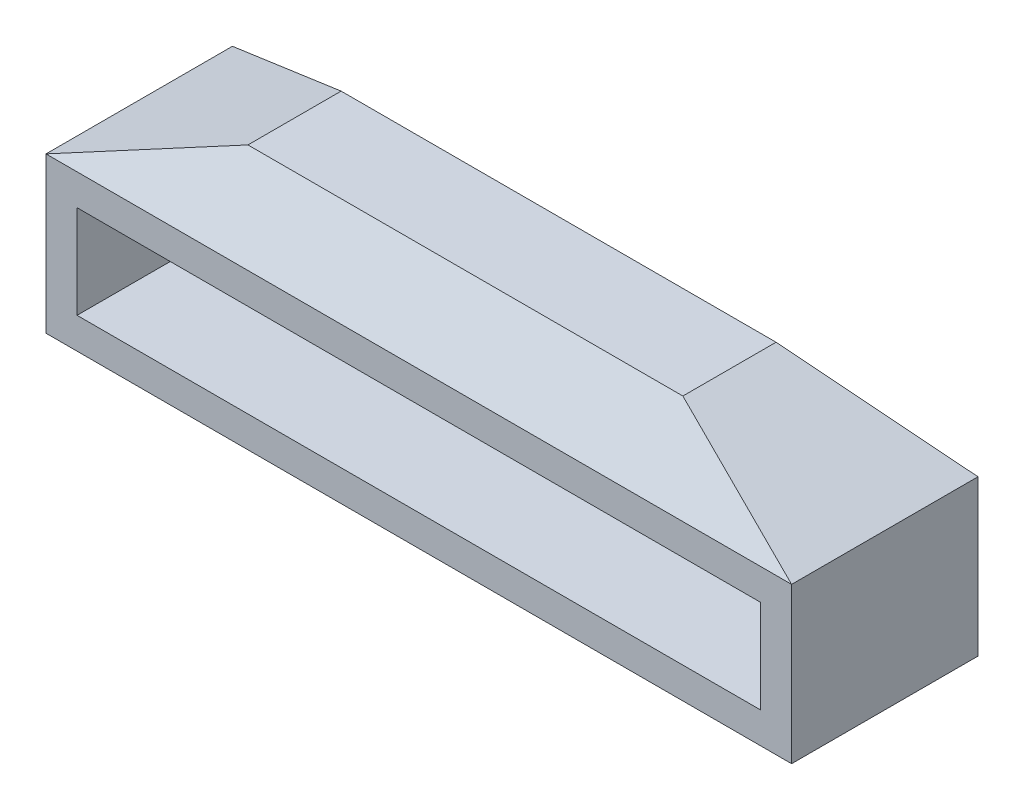
ISO-10303-21;
HEADER;
FILE_DESCRIPTION(('STEP AP214'),'2;1');
FILE_NAME('part.step','',(''),(''),'','','');
FILE_SCHEMA(('AUTOMOTIVE_DESIGN { 1 0 10303 214 1 1 1 1 }'));
ENDSEC;
DATA;
#1=APPLICATION_CONTEXT('core data for automotive mechanical design processes');
#2=APPLICATION_PROTOCOL_DEFINITION('international standard','automotive_design',2000,#1);
#3=PRODUCT_CONTEXT('',#1,'mechanical');
#4=PRODUCT('Part','Part','',(#3));
#5=PRODUCT_RELATED_PRODUCT_CATEGORY('part','',(#4));
#6=PRODUCT_DEFINITION_FORMATION('','',#4);
#7=PRODUCT_DEFINITION_CONTEXT('part definition',#1,'design');
#8=PRODUCT_DEFINITION('design','',#6,#7);
#9=PRODUCT_DEFINITION_SHAPE('','',#8);
#10=(LENGTH_UNIT() NAMED_UNIT(*) SI_UNIT(.MILLI.,.METRE.));
#11=(NAMED_UNIT(*) PLANE_ANGLE_UNIT() SI_UNIT($,.RADIAN.));
#12=(NAMED_UNIT(*) SI_UNIT($,.STERADIAN.) SOLID_ANGLE_UNIT());
#13=UNCERTAINTY_MEASURE_WITH_UNIT(LENGTH_MEASURE(1.E-05),#10,'distance_accuracy_value','');
#14=(GEOMETRIC_REPRESENTATION_CONTEXT(3) GLOBAL_UNCERTAINTY_ASSIGNED_CONTEXT((#13)) GLOBAL_UNIT_ASSIGNED_CONTEXT((#10,
#11,#12)) REPRESENTATION_CONTEXT('',''));
#15=CARTESIAN_POINT('',(0.,0.,0.));
#16=DIRECTION('',(0.,0.,1.));
#17=DIRECTION('',(1.,0.,0.));
#18=AXIS2_PLACEMENT_3D('',#15,#16,#17);
#19=CARTESIAN_POINT('',(11.,4.00000000000001,6.));
#20=DIRECTION('',(0.,-1.,0.));
#21=DIRECTION('',(1.,0.,0.));
#22=AXIS2_PLACEMENT_3D('',#19,#20,#21);
#23=PLANE('',#22);
#24=DIRECTION('',(-1.,0.,0.));
#25=VECTOR('',#24,1.);
#26=CARTESIAN_POINT('',(11.,4.00000000000001,0.));
#27=LINE('',#26,#25);
#28=CARTESIAN_POINT('',(11.,4.00000000000001,0.));
#29=VERTEX_POINT('',#28);
#30=CARTESIAN_POINT('',(-11.,4.,0.));
#31=VERTEX_POINT('',#30);
#32=EDGE_CURVE('E272',#29,#31,#27,.T.);
#33=ORIENTED_EDGE('',*,*,#32,.F.);
#34=DIRECTION('',(0.,0.,-1.));
#35=VECTOR('',#34,1.);
#36=CARTESIAN_POINT('',(11.,4.00000000000001,6.));
#37=LINE('',#36,#35);
#38=CARTESIAN_POINT('',(11.,4.00000000000001,6.));
#39=VERTEX_POINT('',#38);
#40=EDGE_CURVE('E66',#39,#29,#37,.T.);
#41=ORIENTED_EDGE('',*,*,#40,.F.);
#42=DIRECTION('',(-1.,0.,0.));
#43=VECTOR('',#42,1.);
#44=CARTESIAN_POINT('',(11.,4.00000000000001,6.));
#45=LINE('',#44,#43);
#46=CARTESIAN_POINT('',(-11.,4.,6.));
#47=VERTEX_POINT('',#46);
#48=EDGE_CURVE('E276',#39,#47,#45,.T.);
#49=ORIENTED_EDGE('',*,*,#48,.T.);
#50=DIRECTION('',(0.,0.,-1.));
#51=VECTOR('',#50,1.);
#52=CARTESIAN_POINT('',(-11.,4.,6.));
#53=LINE('',#52,#51);
#54=EDGE_CURVE('E278',#47,#31,#53,.T.);
#55=ORIENTED_EDGE('',*,*,#54,.T.);
#56=EDGE_LOOP('',(#33,#41,#49,#55));
#57=FACE_BOUND('',#56,.T.);
#58=DIRECTION('',(1.,0.,0.));
#59=VECTOR('',#58,1.);
#60=CARTESIAN_POINT('',(-6.,4.,2.74999999999999));
#61=LINE('',#60,#59);
#62=CARTESIAN_POINT('',(-6.,4.,2.74999999999999));
#63=VERTEX_POINT('',#62);
#64=CARTESIAN_POINT('',(6.,4.00000000000001,2.74999999999998));
#65=VERTEX_POINT('',#64);
#66=EDGE_CURVE('E51',#63,#65,#61,.T.);
#67=ORIENTED_EDGE('',*,*,#66,.F.);
#68=DIRECTION('',(0.,0.,1.));
#69=VECTOR('',#68,1.);
#70=CARTESIAN_POINT('',(-6.,4.,6.));
#71=LINE('',#70,#69);
#72=CARTESIAN_POINT('',(-6.,4.,3.25000000000001));
#73=VERTEX_POINT('',#72);
#74=EDGE_CURVE('E12',#63,#73,#71,.T.);
#75=ORIENTED_EDGE('',*,*,#74,.T.);
#76=DIRECTION('',(1.,0.,0.));
#77=VECTOR('',#76,1.);
#78=CARTESIAN_POINT('',(-6.,4.,3.25000000000001));
#79=LINE('',#78,#77);
#80=CARTESIAN_POINT('',(6.,4.00000000000001,3.25000000000002));
#81=VERTEX_POINT('',#80);
#82=EDGE_CURVE('E174',#81,#73,#79,.F.);
#83=ORIENTED_EDGE('',*,*,#82,.F.);
#84=DIRECTION('',(0.,0.,1.));
#85=VECTOR('',#84,1.);
#86=CARTESIAN_POINT('',(6.,4.00000000000001,6.));
#87=LINE('',#86,#85);
#88=EDGE_CURVE('E172',#65,#81,#87,.T.);
#89=ORIENTED_EDGE('',*,*,#88,.F.);
#90=EDGE_LOOP('',(#67,#75,#83,#89));
#91=FACE_BOUND('',#90,.T.);
#92=ADVANCED_FACE('F43',(#57,#91),#23,.T.);
#93=CARTESIAN_POINT('',(0.,0.,6.));
#94=DIRECTION('',(0.,0.,1.));
#95=DIRECTION('',(1.,0.,0.));
#96=AXIS2_PLACEMENT_3D('',#93,#94,#95);
#97=PLANE('',#96);
#98=DIRECTION('',(0.,-1.,0.));
#99=VECTOR('',#98,1.);
#100=CARTESIAN_POINT('',(-12.,5.00000000000001,6.));
#101=LINE('',#100,#99);
#102=CARTESIAN_POINT('',(-12.,5.,6.));
#103=VERTEX_POINT('',#102);
#104=CARTESIAN_POINT('',(-12.,0.,6.));
#105=VERTEX_POINT('',#104);
#106=EDGE_CURVE('E157',#103,#105,#101,.T.);
#107=ORIENTED_EDGE('',*,*,#106,.T.);
#108=DIRECTION('',(1.,0.,0.));
#109=VECTOR('',#108,1.);
#110=CARTESIAN_POINT('',(-12.,0.,6.));
#111=LINE('',#110,#109);
#112=CARTESIAN_POINT('',(12.,0.,6.));
#113=VERTEX_POINT('',#112);
#114=EDGE_CURVE('E163',#105,#113,#111,.T.);
#115=ORIENTED_EDGE('',*,*,#114,.T.);
#116=DIRECTION('',(0.,1.,0.));
#117=VECTOR('',#116,1.);
#118=CARTESIAN_POINT('',(12.,0.,6.));
#119=LINE('',#118,#117);
#120=CARTESIAN_POINT('',(12.,5.00000000000001,6.));
#121=VERTEX_POINT('',#120);
#122=EDGE_CURVE('E151',#113,#121,#119,.T.);
#123=ORIENTED_EDGE('',*,*,#122,.T.);
#124=DIRECTION('',(1.,0.,0.));
#125=VECTOR('',#124,1.);
#126=CARTESIAN_POINT('',(0.,5.00000000000001,6.));
#127=LINE('',#126,#125);
#128=EDGE_CURVE('E162',#121,#103,#127,.F.);
#129=ORIENTED_EDGE('',*,*,#128,.T.);
#130=EDGE_LOOP('',(#107,#115,#123,#129));
#131=FACE_BOUND('',#130,.T.);
#132=DIRECTION('',(1.,0.,0.));
#133=VECTOR('',#132,1.);
#134=CARTESIAN_POINT('',(-11.,1.,6.));
#135=LINE('',#134,#133);
#136=CARTESIAN_POINT('',(-11.,1.,6.));
#137=VERTEX_POINT('',#136);
#138=CARTESIAN_POINT('',(11.,0.999999999999998,6.));
#139=VERTEX_POINT('',#138);
#140=EDGE_CURVE('E271',#137,#139,#135,.T.);
#141=ORIENTED_EDGE('',*,*,#140,.F.);
#142=DIRECTION('',(0.,-1.,0.));
#143=VECTOR('',#142,1.);
#144=CARTESIAN_POINT('',(-11.,4.,6.));
#145=LINE('',#144,#143);
#146=EDGE_CURVE('E264',#47,#137,#145,.T.);
#147=ORIENTED_EDGE('',*,*,#146,.F.);
#148=ORIENTED_EDGE('',*,*,#48,.F.);
#149=DIRECTION('',(0.,1.,0.));
#150=VECTOR('',#149,1.);
#151=CARTESIAN_POINT('',(11.,0.999999999999998,6.));
#152=LINE('',#151,#150);
#153=EDGE_CURVE('E274',#139,#39,#152,.T.);
#154=ORIENTED_EDGE('',*,*,#153,.F.);
#155=EDGE_LOOP('',(#141,#147,#148,#154));
#156=FACE_BOUND('',#155,.T.);
#157=ADVANCED_FACE('F299',(#131,#156),#97,.T.);
#158=CARTESIAN_POINT('',(0.,0.,0.));
#159=DIRECTION('',(0.,0.,1.));
#160=DIRECTION('',(1.,0.,0.));
#161=AXIS2_PLACEMENT_3D('',#158,#159,#160);
#162=PLANE('',#161);
#163=DIRECTION('',(0.,-1.,0.));
#164=VECTOR('',#163,1.);
#165=CARTESIAN_POINT('',(-12.,5.00000000000001,0.));
#166=LINE('',#165,#164);
#167=CARTESIAN_POINT('',(-12.,5.00000000000001,0.));
#168=VERTEX_POINT('',#167);
#169=CARTESIAN_POINT('',(-12.,0.,0.));
#170=VERTEX_POINT('',#169);
#171=EDGE_CURVE('E145',#168,#170,#166,.T.);
#172=ORIENTED_EDGE('',*,*,#171,.F.);
#173=DIRECTION('',(1.,0.,0.));
#174=VECTOR('',#173,1.);
#175=CARTESIAN_POINT('',(0.,5.00000000000001,0.));
#176=LINE('',#175,#174);
#177=CARTESIAN_POINT('',(12.,5.00000000000001,0.));
#178=VERTEX_POINT('',#177);
#179=EDGE_CURVE('E91',#178,#168,#176,.F.);
#180=ORIENTED_EDGE('',*,*,#179,.F.);
#181=DIRECTION('',(0.,1.,0.));
#182=VECTOR('',#181,1.);
#183=CARTESIAN_POINT('',(12.,0.,0.));
#184=LINE('',#183,#182);
#185=CARTESIAN_POINT('',(12.,0.,0.));
#186=VERTEX_POINT('',#185);
#187=EDGE_CURVE('E144',#186,#178,#184,.T.);
#188=ORIENTED_EDGE('',*,*,#187,.F.);
#189=DIRECTION('',(1.,0.,0.));
#190=VECTOR('',#189,1.);
#191=CARTESIAN_POINT('',(-12.,0.,0.));
#192=LINE('',#191,#190);
#193=EDGE_CURVE('E136',#170,#186,#192,.T.);
#194=ORIENTED_EDGE('',*,*,#193,.F.);
#195=EDGE_LOOP('',(#172,#180,#188,#194));
#196=FACE_BOUND('',#195,.T.);
#197=DIRECTION('',(0.,-1.,0.));
#198=VECTOR('',#197,1.);
#199=CARTESIAN_POINT('',(-11.,4.,0.));
#200=LINE('',#199,#198);
#201=CARTESIAN_POINT('',(-11.,1.,0.));
#202=VERTEX_POINT('',#201);
#203=EDGE_CURVE('E279',#31,#202,#200,.T.);
#204=ORIENTED_EDGE('',*,*,#203,.T.);
#205=DIRECTION('',(1.,0.,0.));
#206=VECTOR('',#205,1.);
#207=CARTESIAN_POINT('',(-11.,1.,0.));
#208=LINE('',#207,#206);
#209=CARTESIAN_POINT('',(11.,0.999999999999998,0.));
#210=VERTEX_POINT('',#209);
#211=EDGE_CURVE('E282',#202,#210,#208,.T.);
#212=ORIENTED_EDGE('',*,*,#211,.T.);
#213=DIRECTION('',(0.,1.,0.));
#214=VECTOR('',#213,1.);
#215=CARTESIAN_POINT('',(11.,0.999999999999998,0.));
#216=LINE('',#215,#214);
#217=EDGE_CURVE('E286',#210,#29,#216,.T.);
#218=ORIENTED_EDGE('',*,*,#217,.T.);
#219=ORIENTED_EDGE('',*,*,#32,.T.);
#220=EDGE_LOOP('',(#204,#212,#218,#219));
#221=FACE_BOUND('',#220,.T.);
#222=ADVANCED_FACE('F154',(#196,#221),#162,.F.);
#223=CARTESIAN_POINT('',(-12.,5.00000000000001,6.));
#224=DIRECTION('',(1.,0.,0.));
#225=DIRECTION('',(0.,0.,-1.));
#226=AXIS2_PLACEMENT_3D('',#223,#224,#225);
#227=PLANE('',#226);
#228=ORIENTED_EDGE('',*,*,#171,.T.);
#229=DIRECTION('',(0.,0.,-1.));
#230=VECTOR('',#229,1.);
#231=CARTESIAN_POINT('',(-12.,0.,6.));
#232=LINE('',#231,#230);
#233=EDGE_CURVE('E142',#105,#170,#232,.T.);
#234=ORIENTED_EDGE('',*,*,#233,.F.);
#235=ORIENTED_EDGE('',*,*,#106,.F.);
#236=DIRECTION('',(0.,0.,-1.));
#237=VECTOR('',#236,1.);
#238=CARTESIAN_POINT('',(-12.,5.00000000000001,6.));
#239=LINE('',#238,#237);
#240=EDGE_CURVE('E168',#103,#168,#239,.T.);
#241=ORIENTED_EDGE('',*,*,#240,.T.);
#242=EDGE_LOOP('',(#228,#234,#235,#241));
#243=FACE_BOUND('',#242,.T.);
#244=ADVANCED_FACE('F45',(#243),#227,.F.);
#245=CARTESIAN_POINT('',(-12.,0.,6.));
#246=DIRECTION('',(0.,1.,0.));
#247=DIRECTION('',(0.,0.,1.));
#248=AXIS2_PLACEMENT_3D('',#245,#246,#247);
#249=PLANE('',#248);
#250=ORIENTED_EDGE('',*,*,#193,.T.);
#251=DIRECTION('',(0.,0.,-1.));
#252=VECTOR('',#251,1.);
#253=CARTESIAN_POINT('',(12.,0.,6.));
#254=LINE('',#253,#252);
#255=EDGE_CURVE('E139',#113,#186,#254,.T.);
#256=ORIENTED_EDGE('',*,*,#255,.F.);
#257=ORIENTED_EDGE('',*,*,#114,.F.);
#258=ORIENTED_EDGE('',*,*,#233,.T.);
#259=EDGE_LOOP('',(#250,#256,#257,#258));
#260=FACE_BOUND('',#259,.T.);
#261=ADVANCED_FACE('F138',(#260),#249,.F.);
#262=CARTESIAN_POINT('',(12.,0.,6.));
#263=DIRECTION('',(-1.,0.,0.));
#264=DIRECTION('',(0.,0.,1.));
#265=AXIS2_PLACEMENT_3D('',#262,#263,#264);
#266=PLANE('',#265);
#267=ORIENTED_EDGE('',*,*,#187,.T.);
#268=DIRECTION('',(0.,0.,1.));
#269=VECTOR('',#268,1.);
#270=CARTESIAN_POINT('',(12.,5.,0.));
#271=LINE('',#270,#269);
#272=EDGE_CURVE('E152',#121,#178,#271,.F.);
#273=ORIENTED_EDGE('',*,*,#272,.F.);
#274=ORIENTED_EDGE('',*,*,#122,.F.);
#275=ORIENTED_EDGE('',*,*,#255,.T.);
#276=EDGE_LOOP('',(#267,#273,#274,#275));
#277=FACE_BOUND('',#276,.T.);
#278=ADVANCED_FACE('F148',(#277),#266,.F.);
#279=CARTESIAN_POINT('',(-11.,4.,6.));
#280=DIRECTION('',(1.,0.,0.));
#281=DIRECTION('',(0.,0.,-1.));
#282=AXIS2_PLACEMENT_3D('',#279,#280,#281);
#283=PLANE('',#282);
#284=ORIENTED_EDGE('',*,*,#203,.F.);
#285=ORIENTED_EDGE('',*,*,#54,.F.);
#286=ORIENTED_EDGE('',*,*,#146,.T.);
#287=DIRECTION('',(0.,0.,-1.));
#288=VECTOR('',#287,1.);
#289=CARTESIAN_POINT('',(-11.,1.,6.));
#290=LINE('',#289,#288);
#291=EDGE_CURVE('E166',#137,#202,#290,.T.);
#292=ORIENTED_EDGE('',*,*,#291,.T.);
#293=EDGE_LOOP('',(#284,#285,#286,#292));
#294=FACE_BOUND('',#293,.T.);
#295=ADVANCED_FACE('F348',(#294),#283,.T.);
#296=CARTESIAN_POINT('',(-11.,1.,6.));
#297=DIRECTION('',(0.,1.,0.));
#298=DIRECTION('',(-1.,0.,0.));
#299=AXIS2_PLACEMENT_3D('',#296,#297,#298);
#300=PLANE('',#299);
#301=ORIENTED_EDGE('',*,*,#211,.F.);
#302=ORIENTED_EDGE('',*,*,#291,.F.);
#303=ORIENTED_EDGE('',*,*,#140,.T.);
#304=DIRECTION('',(0.,0.,-1.));
#305=VECTOR('',#304,1.);
#306=CARTESIAN_POINT('',(11.,0.999999999999998,6.));
#307=LINE('',#306,#305);
#308=EDGE_CURVE('E294',#139,#210,#307,.T.);
#309=ORIENTED_EDGE('',*,*,#308,.T.);
#310=EDGE_LOOP('',(#301,#302,#303,#309));
#311=FACE_BOUND('',#310,.T.);
#312=ADVANCED_FACE('F344',(#311),#300,.T.);
#313=CARTESIAN_POINT('',(11.,0.999999999999998,6.));
#314=DIRECTION('',(-1.,0.,0.));
#315=DIRECTION('',(0.,0.,1.));
#316=AXIS2_PLACEMENT_3D('',#313,#314,#315);
#317=PLANE('',#316);
#318=ORIENTED_EDGE('',*,*,#217,.F.);
#319=ORIENTED_EDGE('',*,*,#308,.F.);
#320=ORIENTED_EDGE('',*,*,#153,.T.);
#321=ORIENTED_EDGE('',*,*,#40,.T.);
#322=EDGE_LOOP('',(#318,#319,#320,#321));
#323=FACE_BOUND('',#322,.T.);
#324=ADVANCED_FACE('F237',(#323),#317,.T.);
#325=CARTESIAN_POINT('',(0.,7.00000000000001,0.));
#326=DIRECTION('',(0.,1.,0.));
#327=DIRECTION('',(-1.,0.,0.));
#328=AXIS2_PLACEMENT_3D('',#325,#326,#327);
#329=PLANE('',#328);
#330=DIRECTION('',(-1.,0.,0.));
#331=VECTOR('',#330,1.);
#332=CARTESIAN_POINT('',(7.,7.00000000000001,1.5));
#333=LINE('',#332,#331);
#334=CARTESIAN_POINT('',(7.,7.00000000000001,1.5));
#335=VERTEX_POINT('',#334);
#336=CARTESIAN_POINT('',(-7.,7.,1.5));
#337=VERTEX_POINT('',#336);
#338=EDGE_CURVE('E259',#335,#337,#333,.T.);
#339=ORIENTED_EDGE('',*,*,#338,.T.);
#340=DIRECTION('',(0.,0.,1.));
#341=VECTOR('',#340,1.);
#342=CARTESIAN_POINT('',(-7.,7.,1.5));
#343=LINE('',#342,#341);
#344=CARTESIAN_POINT('',(-7.,7.,4.5));
#345=VERTEX_POINT('',#344);
#346=EDGE_CURVE('E217',#337,#345,#343,.T.);
#347=ORIENTED_EDGE('',*,*,#346,.T.);
#348=DIRECTION('',(1.,0.,0.));
#349=VECTOR('',#348,1.);
#350=CARTESIAN_POINT('',(-7.,7.,4.5));
#351=LINE('',#350,#349);
#352=CARTESIAN_POINT('',(7.,7.00000000000001,4.5));
#353=VERTEX_POINT('',#352);
#354=EDGE_CURVE('E103',#345,#353,#351,.T.);
#355=ORIENTED_EDGE('',*,*,#354,.T.);
#356=DIRECTION('',(0.,0.,-1.));
#357=VECTOR('',#356,1.);
#358=CARTESIAN_POINT('',(7.,7.00000000000001,4.5));
#359=LINE('',#358,#357);
#360=EDGE_CURVE('E200',#353,#335,#359,.T.);
#361=ORIENTED_EDGE('',*,*,#360,.T.);
#362=EDGE_LOOP('',(#339,#347,#355,#361));
#363=FACE_BOUND('',#362,.T.);
#364=ADVANCED_FACE('F216',(#363),#329,.T.);
#365=CARTESIAN_POINT('',(0.,4.68000000000001,6.24));
#366=DIRECTION('',(0.,-0.600000000000001,-0.799999999999999));
#367=DIRECTION('',(0.,0.799999999999999,-0.600000000000001));
#368=AXIS2_PLACEMENT_3D('',#365,#366,#367);
#369=PLANE('',#368);
#370=DIRECTION('',(-0.894427190999916,0.357770876399966,-0.268328157299975));
#371=VECTOR('',#370,1.);
#372=CARTESIAN_POINT('',(12.,5.00000000000001,6.));
#373=LINE('',#372,#371);
#374=EDGE_CURVE('E195',#121,#353,#373,.T.);
#375=ORIENTED_EDGE('',*,*,#374,.T.);
#376=ORIENTED_EDGE('',*,*,#354,.F.);
#377=DIRECTION('',(0.894427190999916,0.357770876399966,-0.268328157299975));
#378=VECTOR('',#377,1.);
#379=CARTESIAN_POINT('',(-12.,5.00000000000001,6.));
#380=LINE('',#379,#378);
#381=EDGE_CURVE('E199',#103,#345,#380,.T.);
#382=ORIENTED_EDGE('',*,*,#381,.F.);
#383=ORIENTED_EDGE('',*,*,#128,.F.);
#384=EDGE_LOOP('',(#375,#376,#382,#383));
#385=FACE_BOUND('',#384,.T.);
#386=ADVANCED_FACE('F197',(#385),#369,.F.);
#387=CARTESIAN_POINT('',(-3.37931034482759,8.44827586206897,0.));
#388=DIRECTION('',(0.371390676354104,-0.928476690885259,0.));
#389=DIRECTION('',(0.92847669088526,0.371390676354104,0.));
#390=AXIS2_PLACEMENT_3D('',#387,#388,#389);
#391=PLANE('',#390);
#392=ORIENTED_EDGE('',*,*,#381,.T.);
#393=ORIENTED_EDGE('',*,*,#346,.F.);
#394=DIRECTION('',(0.894427190999916,0.357770876399966,0.268328157299975));
#395=VECTOR('',#394,1.);
#396=CARTESIAN_POINT('',(-12.,5.00000000000001,0.));
#397=LINE('',#396,#395);
#398=EDGE_CURVE('E283',#168,#337,#397,.T.);
#399=ORIENTED_EDGE('',*,*,#398,.F.);
#400=ORIENTED_EDGE('',*,*,#240,.F.);
#401=EDGE_LOOP('',(#392,#393,#399,#400));
#402=FACE_BOUND('',#401,.T.);
#403=ADVANCED_FACE('F309',(#402),#391,.F.);
#404=CARTESIAN_POINT('',(3.37931034482759,8.44827586206897,0.));
#405=DIRECTION('',(-0.371390676354104,-0.928476690885259,0.));
#406=DIRECTION('',(0.928476690885259,-0.371390676354104,0.));
#407=AXIS2_PLACEMENT_3D('',#404,#405,#406);
#408=PLANE('',#407);
#409=DIRECTION('',(-0.894427190999916,0.357770876399966,0.268328157299975));
#410=VECTOR('',#409,1.);
#411=CARTESIAN_POINT('',(12.,5.00000000000001,0.));
#412=LINE('',#411,#410);
#413=EDGE_CURVE('E206',#178,#335,#412,.T.);
#414=ORIENTED_EDGE('',*,*,#413,.T.);
#415=ORIENTED_EDGE('',*,*,#360,.F.);
#416=ORIENTED_EDGE('',*,*,#374,.F.);
#417=ORIENTED_EDGE('',*,*,#272,.T.);
#418=EDGE_LOOP('',(#414,#415,#416,#417));
#419=FACE_BOUND('',#418,.T.);
#420=ADVANCED_FACE('F204',(#419),#408,.F.);
#421=CARTESIAN_POINT('',(0.,1.80000000000001,-2.4));
#422=DIRECTION('',(0.,-0.600000000000001,0.799999999999999));
#423=DIRECTION('',(0.,-0.799999999999999,-0.600000000000001));
#424=AXIS2_PLACEMENT_3D('',#421,#422,#423);
#425=PLANE('',#424);
#426=ORIENTED_EDGE('',*,*,#398,.T.);
#427=ORIENTED_EDGE('',*,*,#338,.F.);
#428=ORIENTED_EDGE('',*,*,#413,.F.);
#429=ORIENTED_EDGE('',*,*,#179,.T.);
#430=EDGE_LOOP('',(#426,#427,#428,#429));
#431=FACE_BOUND('',#430,.T.);
#432=ADVANCED_FACE('F307',(#431),#425,.F.);
#433=CARTESIAN_POINT('',(-6.,5.22474487139159,3.));
#434=DIRECTION('',(1.,0.,0.));
#435=DIRECTION('',(0.,0.,-1.));
#436=AXIS2_PLACEMENT_3D('',#433,#434,#435);
#437=CYLINDRICAL_SURFACE('',#436,1.25);
#438=ORIENTED_EDGE('',*,*,#66,.T.);
#439=CARTESIAN_POINT('',(6.,5.22474487139159,3.));
#440=DIRECTION('',(1.,0.,0.));
#441=DIRECTION('',(0.,0.,-1.));
#442=AXIS2_PLACEMENT_3D('',#439,#440,#441);
#443=CIRCLE('',#442,1.25);
#444=EDGE_CURVE('E57',#65,#81,#443,.T.);
#445=ORIENTED_EDGE('',*,*,#444,.T.);
#446=ORIENTED_EDGE('',*,*,#82,.T.);
#447=CARTESIAN_POINT('',(-6.,5.22474487139159,3.));
#448=DIRECTION('',(1.,0.,0.));
#449=DIRECTION('',(0.,0.,-1.));
#450=AXIS2_PLACEMENT_3D('',#447,#448,#449);
#451=CIRCLE('',#450,1.25);
#452=EDGE_CURVE('E185',#63,#73,#451,.T.);
#453=ORIENTED_EDGE('',*,*,#452,.F.);
#454=EDGE_LOOP('',(#438,#445,#446,#453));
#455=FACE_BOUND('',#454,.T.);
#456=ADVANCED_FACE('F180',(#455),#437,.F.);
#457=CARTESIAN_POINT('',(-6.,5.22474487139159,3.));
#458=DIRECTION('',(1.,0.,0.));
#459=DIRECTION('',(0.,0.,-1.));
#460=AXIS2_PLACEMENT_3D('',#457,#458,#459);
#461=PLANE('',#460);
#462=ORIENTED_EDGE('',*,*,#452,.T.);
#463=ORIENTED_EDGE('',*,*,#74,.F.);
#464=EDGE_LOOP('',(#462,#463));
#465=FACE_BOUND('',#464,.T.);
#466=ADVANCED_FACE('F325',(#465),#461,.T.);
#467=CARTESIAN_POINT('',(6.,5.22474487139159,3.));
#468=DIRECTION('',(1.,0.,0.));
#469=DIRECTION('',(0.,0.,-1.));
#470=AXIS2_PLACEMENT_3D('',#467,#468,#469);
#471=PLANE('',#470);
#472=ORIENTED_EDGE('',*,*,#88,.T.);
#473=ORIENTED_EDGE('',*,*,#444,.F.);
#474=EDGE_LOOP('',(#472,#473));
#475=FACE_BOUND('',#474,.T.);
#476=ADVANCED_FACE('F187',(#475),#471,.F.);
#477=CLOSED_SHELL('',(#92,#157,#222,#244,#261,#278,#295,#312,#324,#364,#386,#403,#420,#432,#456,
#466,#476));
#478=MANIFOLD_SOLID_BREP('B2',#477);
#479=ADVANCED_BREP_SHAPE_REPRESENTATION('',(#18,#478),#14);
#480=SHAPE_DEFINITION_REPRESENTATION(#9,#479);
ENDSEC;
END-ISO-10303-21;
